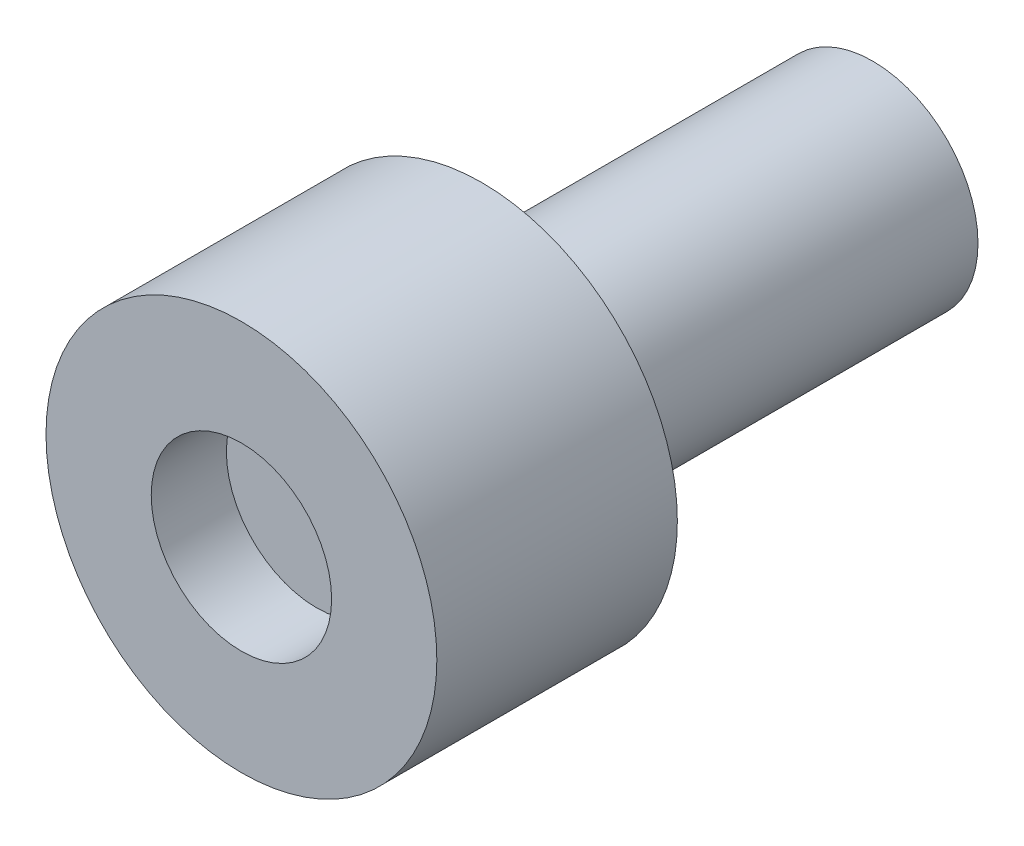
ISO-10303-21;
HEADER;
FILE_DESCRIPTION(('STEP AP214'),'2;1');
FILE_NAME('part.step','',(''),(''),'','','');
FILE_SCHEMA(('AUTOMOTIVE_DESIGN { 1 0 10303 214 1 1 1 1 }'));
ENDSEC;
DATA;
#1=APPLICATION_CONTEXT('core data for automotive mechanical design processes');
#2=APPLICATION_PROTOCOL_DEFINITION('international standard','automotive_design',2000,#1);
#3=PRODUCT_CONTEXT('',#1,'mechanical');
#4=PRODUCT('Part','Part','',(#3));
#5=PRODUCT_RELATED_PRODUCT_CATEGORY('part','',(#4));
#6=PRODUCT_DEFINITION_FORMATION('','',#4);
#7=PRODUCT_DEFINITION_CONTEXT('part definition',#1,'design');
#8=PRODUCT_DEFINITION('design','',#6,#7);
#9=PRODUCT_DEFINITION_SHAPE('','',#8);
#10=(LENGTH_UNIT() NAMED_UNIT(*) SI_UNIT(.MILLI.,.METRE.));
#11=(NAMED_UNIT(*) PLANE_ANGLE_UNIT() SI_UNIT($,.RADIAN.));
#12=(NAMED_UNIT(*) SI_UNIT($,.STERADIAN.) SOLID_ANGLE_UNIT());
#13=UNCERTAINTY_MEASURE_WITH_UNIT(LENGTH_MEASURE(1.E-05),#10,'distance_accuracy_value','');
#14=(GEOMETRIC_REPRESENTATION_CONTEXT(3) GLOBAL_UNCERTAINTY_ASSIGNED_CONTEXT((#13)) GLOBAL_UNIT_ASSIGNED_CONTEXT((#10,
#11,#12)) REPRESENTATION_CONTEXT('',''));
#15=CARTESIAN_POINT('',(0.,0.,0.));
#16=DIRECTION('',(0.,0.,1.));
#17=DIRECTION('',(1.,0.,0.));
#18=AXIS2_PLACEMENT_3D('',#15,#16,#17);
#19=CARTESIAN_POINT('',(0.,0.,8.));
#20=DIRECTION('',(0.,0.,-1.));
#21=DIRECTION('',(-1.,0.,0.));
#22=AXIS2_PLACEMENT_3D('',#19,#20,#21);
#23=CYLINDRICAL_SURFACE('',#22,3.);
#24=CARTESIAN_POINT('',(0.,0.,5.5));
#25=DIRECTION('',(0.,0.,-1.));
#26=DIRECTION('',(-1.,0.,0.));
#27=AXIS2_PLACEMENT_3D('',#24,#25,#26);
#28=CIRCLE('',#27,3.);
#29=CARTESIAN_POINT('',(-3.,0.,5.5));
#30=VERTEX_POINT('',#29);
#31=EDGE_CURVE('E53',#30,#30,#28,.T.);
#32=ORIENTED_EDGE('',*,*,#31,.T.);
#33=EDGE_LOOP('',(#32));
#34=FACE_BOUND('',#33,.T.);
#35=CARTESIAN_POINT('',(0.,0.,8.));
#36=DIRECTION('',(0.,0.,-1.));
#37=DIRECTION('',(-1.,0.,0.));
#38=AXIS2_PLACEMENT_3D('',#35,#36,#37);
#39=CIRCLE('',#38,3.);
#40=CARTESIAN_POINT('',(-3.,0.,8.));
#41=VERTEX_POINT('',#40);
#42=EDGE_CURVE('E10',#41,#41,#39,.T.);
#43=ORIENTED_EDGE('',*,*,#42,.F.);
#44=EDGE_LOOP('',(#43));
#45=FACE_BOUND('',#44,.T.);
#46=ADVANCED_FACE('F31',(#34,#45),#23,.F.);
#47=CARTESIAN_POINT('',(6.5,0.,8.));
#48=DIRECTION('',(0.,0.,1.));
#49=DIRECTION('',(1.,0.,0.));
#50=AXIS2_PLACEMENT_3D('',#47,#48,#49);
#51=PLANE('',#50);
#52=ORIENTED_EDGE('',*,*,#42,.T.);
#53=EDGE_LOOP('',(#52));
#54=FACE_BOUND('',#53,.T.);
#55=CARTESIAN_POINT('',(0.,0.,8.));
#56=DIRECTION('',(0.,0.,-1.));
#57=DIRECTION('',(-1.,0.,0.));
#58=AXIS2_PLACEMENT_3D('',#55,#56,#57);
#59=CIRCLE('',#58,6.5);
#60=CARTESIAN_POINT('',(-6.5,0.,8.));
#61=VERTEX_POINT('',#60);
#62=EDGE_CURVE('E37',#61,#61,#59,.T.);
#63=ORIENTED_EDGE('',*,*,#62,.F.);
#64=EDGE_LOOP('',(#63));
#65=FACE_BOUND('',#64,.T.);
#66=ADVANCED_FACE('F70',(#54,#65),#51,.T.);
#67=CARTESIAN_POINT('',(0.,0.,8.));
#68=DIRECTION('',(0.,0.,-1.));
#69=DIRECTION('',(-1.,0.,0.));
#70=AXIS2_PLACEMENT_3D('',#67,#68,#69);
#71=CYLINDRICAL_SURFACE('',#70,6.5);
#72=ORIENTED_EDGE('',*,*,#62,.T.);
#73=EDGE_LOOP('',(#72));
#74=FACE_BOUND('',#73,.T.);
#75=CARTESIAN_POINT('',(0.,0.,0.));
#76=DIRECTION('',(0.,0.,-1.));
#77=DIRECTION('',(-1.,0.,0.));
#78=AXIS2_PLACEMENT_3D('',#75,#76,#77);
#79=CIRCLE('',#78,6.5);
#80=CARTESIAN_POINT('',(-6.5,0.,0.));
#81=VERTEX_POINT('',#80);
#82=EDGE_CURVE('E41',#81,#81,#79,.T.);
#83=ORIENTED_EDGE('',*,*,#82,.F.);
#84=EDGE_LOOP('',(#83));
#85=FACE_BOUND('',#84,.T.);
#86=ADVANCED_FACE('F74',(#74,#85),#71,.T.);
#87=CARTESIAN_POINT('',(3.5,0.,0.));
#88=DIRECTION('',(0.,0.,-1.));
#89=DIRECTION('',(-1.,0.,0.));
#90=AXIS2_PLACEMENT_3D('',#87,#88,#89);
#91=PLANE('',#90);
#92=ORIENTED_EDGE('',*,*,#82,.T.);
#93=EDGE_LOOP('',(#92));
#94=FACE_BOUND('',#93,.T.);
#95=CARTESIAN_POINT('',(0.,0.,0.));
#96=DIRECTION('',(0.,0.,-1.));
#97=DIRECTION('',(-1.,0.,0.));
#98=AXIS2_PLACEMENT_3D('',#95,#96,#97);
#99=CIRCLE('',#98,3.5);
#100=CARTESIAN_POINT('',(-3.5,0.,0.));
#101=VERTEX_POINT('',#100);
#102=EDGE_CURVE('E45',#101,#101,#99,.T.);
#103=ORIENTED_EDGE('',*,*,#102,.F.);
#104=EDGE_LOOP('',(#103));
#105=FACE_BOUND('',#104,.T.);
#106=ADVANCED_FACE('F78',(#94,#105),#91,.T.);
#107=CARTESIAN_POINT('',(0.,0.,8.));
#108=DIRECTION('',(0.,0.,-1.));
#109=DIRECTION('',(-1.,0.,0.));
#110=AXIS2_PLACEMENT_3D('',#107,#108,#109);
#111=CYLINDRICAL_SURFACE('',#110,3.5);
#112=ORIENTED_EDGE('',*,*,#102,.T.);
#113=EDGE_LOOP('',(#112));
#114=FACE_BOUND('',#113,.T.);
#115=CARTESIAN_POINT('',(0.,0.,-13.));
#116=DIRECTION('',(0.,0.,-1.));
#117=DIRECTION('',(-1.,0.,0.));
#118=AXIS2_PLACEMENT_3D('',#115,#116,#117);
#119=CIRCLE('',#118,3.5);
#120=CARTESIAN_POINT('',(-3.5,0.,-13.));
#121=VERTEX_POINT('',#120);
#122=EDGE_CURVE('E50',#121,#121,#119,.T.);
#123=ORIENTED_EDGE('',*,*,#122,.F.);
#124=EDGE_LOOP('',(#123));
#125=FACE_BOUND('',#124,.T.);
#126=ADVANCED_FACE('F66',(#114,#125),#111,.T.);
#127=CARTESIAN_POINT('',(0.,0.,-13.));
#128=DIRECTION('',(0.,0.,-1.));
#129=DIRECTION('',(-1.,0.,0.));
#130=AXIS2_PLACEMENT_3D('',#127,#128,#129);
#131=PLANE('',#130);
#132=ORIENTED_EDGE('',*,*,#122,.T.);
#133=EDGE_LOOP('',(#132));
#134=FACE_BOUND('',#133,.T.);
#135=ADVANCED_FACE('F61',(#134),#131,.T.);
#136=CARTESIAN_POINT('',(3.,0.,5.5));
#137=DIRECTION('',(0.,0.,1.));
#138=DIRECTION('',(1.,0.,0.));
#139=AXIS2_PLACEMENT_3D('',#136,#137,#138);
#140=PLANE('',#139);
#141=ORIENTED_EDGE('',*,*,#31,.F.);
#142=EDGE_LOOP('',(#141));
#143=FACE_BOUND('',#142,.T.);
#144=ADVANCED_FACE('F59',(#143),#140,.T.);
#145=CLOSED_SHELL('',(#46,#66,#86,#106,#126,#135,#144));
#146=MANIFOLD_SOLID_BREP('B2',#145);
#147=ADVANCED_BREP_SHAPE_REPRESENTATION('',(#18,#146),#14);
#148=SHAPE_DEFINITION_REPRESENTATION(#9,#147);
ENDSEC;
END-ISO-10303-21;
